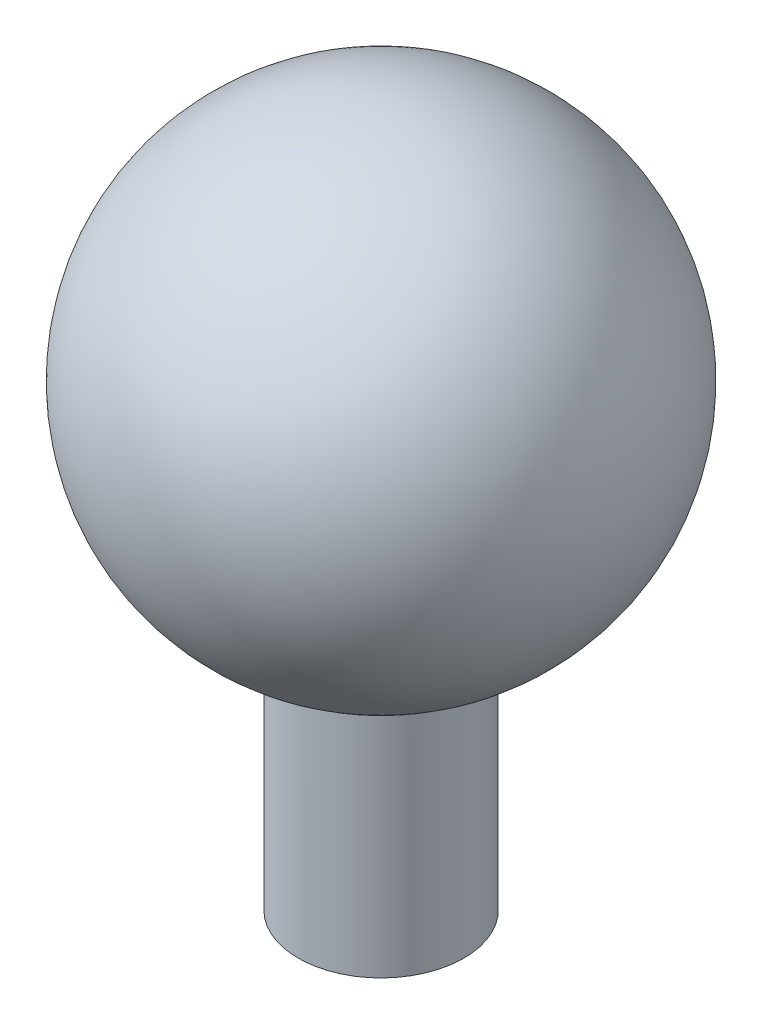
ISO-10303-21;
HEADER;
FILE_DESCRIPTION(('STEP AP214'),'2;1');
FILE_NAME('part.step','',(''),(''),'','','');
FILE_SCHEMA(('AUTOMOTIVE_DESIGN { 1 0 10303 214 1 1 1 1 }'));
ENDSEC;
DATA;
#1=APPLICATION_CONTEXT('core data for automotive mechanical design processes');
#2=APPLICATION_PROTOCOL_DEFINITION('international standard','automotive_design',2000,#1);
#3=PRODUCT_CONTEXT('',#1,'mechanical');
#4=PRODUCT('Part','Part','',(#3));
#5=PRODUCT_RELATED_PRODUCT_CATEGORY('part','',(#4));
#6=PRODUCT_DEFINITION_FORMATION('','',#4);
#7=PRODUCT_DEFINITION_CONTEXT('part definition',#1,'design');
#8=PRODUCT_DEFINITION('design','',#6,#7);
#9=PRODUCT_DEFINITION_SHAPE('','',#8);
#10=(LENGTH_UNIT() NAMED_UNIT(*) SI_UNIT(.MILLI.,.METRE.));
#11=(NAMED_UNIT(*) PLANE_ANGLE_UNIT() SI_UNIT($,.RADIAN.));
#12=(NAMED_UNIT(*) SI_UNIT($,.STERADIAN.) SOLID_ANGLE_UNIT());
#13=UNCERTAINTY_MEASURE_WITH_UNIT(LENGTH_MEASURE(1.E-05),#10,'distance_accuracy_value','');
#14=(GEOMETRIC_REPRESENTATION_CONTEXT(3) GLOBAL_UNCERTAINTY_ASSIGNED_CONTEXT((#13)) GLOBAL_UNIT_ASSIGNED_CONTEXT((#10,
#11,#12)) REPRESENTATION_CONTEXT('',''));
#15=CARTESIAN_POINT('',(0.,0.,0.));
#16=DIRECTION('',(0.,0.,1.));
#17=DIRECTION('',(1.,0.,0.));
#18=AXIS2_PLACEMENT_3D('',#15,#16,#17);
#19=CARTESIAN_POINT('',(0.,38.7349939951952,0.));
#20=DIRECTION('',(0.,-1.,0.));
#21=DIRECTION('',(-1.,0.,0.));
#22=AXIS2_PLACEMENT_3D('',#19,#20,#21);
#23=SPHERICAL_SURFACE('',#22,20.);
#24=CARTESIAN_POINT('',(0.,20.,0.));
#25=DIRECTION('',(0.,-1.,0.));
#26=DIRECTION('',(0.,0.,-1.));
#27=AXIS2_PLACEMENT_3D('',#24,#25,#26);
#28=CIRCLE('',#27,7.);
#29=CARTESIAN_POINT('',(0.,20.,-7.));
#30=VERTEX_POINT('',#29);
#31=EDGE_CURVE('E10',#30,#30,#28,.T.);
#32=ORIENTED_EDGE('',*,*,#31,.F.);
#33=EDGE_LOOP('',(#32));
#34=FACE_BOUND('',#33,.T.);
#35=ADVANCED_FACE('F38',(#34),#23,.T.);
#36=CARTESIAN_POINT('',(0.,0.,0.));
#37=DIRECTION('',(0.,-1.,0.));
#38=DIRECTION('',(0.,0.,-1.));
#39=AXIS2_PLACEMENT_3D('',#36,#37,#38);
#40=CYLINDRICAL_SURFACE('',#39,7.);
#41=ORIENTED_EDGE('',*,*,#31,.T.);
#42=EDGE_LOOP('',(#41));
#43=FACE_BOUND('',#42,.T.);
#44=CARTESIAN_POINT('',(0.,0.,0.));
#45=DIRECTION('',(0.,-1.,0.));
#46=DIRECTION('',(0.,0.,-1.));
#47=AXIS2_PLACEMENT_3D('',#44,#45,#46);
#48=CIRCLE('',#47,7.);
#49=CARTESIAN_POINT('',(0.,0.,-7.));
#50=VERTEX_POINT('',#49);
#51=EDGE_CURVE('E44',#50,#50,#48,.T.);
#52=ORIENTED_EDGE('',*,*,#51,.F.);
#53=EDGE_LOOP('',(#52));
#54=FACE_BOUND('',#53,.T.);
#55=ADVANCED_FACE('F62',(#43,#54),#40,.T.);
#56=CARTESIAN_POINT('',(0.,0.,0.));
#57=DIRECTION('',(0.,-1.,0.));
#58=DIRECTION('',(0.,0.,-1.));
#59=AXIS2_PLACEMENT_3D('',#56,#57,#58);
#60=PLANE('',#59);
#61=CARTESIAN_POINT('',(0.,0.,0.));
#62=DIRECTION('',(0.,-1.,0.));
#63=DIRECTION('',(0.,0.,-1.));
#64=AXIS2_PLACEMENT_3D('',#61,#62,#63);
#65=CIRCLE('',#64,3.);
#66=CARTESIAN_POINT('',(0.,0.,-3.));
#67=VERTEX_POINT('',#66);
#68=EDGE_CURVE('E52',#67,#67,#65,.T.);
#69=ORIENTED_EDGE('',*,*,#68,.F.);
#70=EDGE_LOOP('',(#69));
#71=FACE_BOUND('',#70,.T.);
#72=ORIENTED_EDGE('',*,*,#51,.T.);
#73=EDGE_LOOP('',(#72));
#74=FACE_BOUND('',#73,.T.);
#75=ADVANCED_FACE('F60',(#71,#74),#60,.T.);
#76=CARTESIAN_POINT('',(0.,48.,0.));
#77=DIRECTION('',(0.,-1.,0.));
#78=DIRECTION('',(0.,0.,-1.));
#79=AXIS2_PLACEMENT_3D('',#76,#77,#78);
#80=CYLINDRICAL_SURFACE('',#79,3.);
#81=CARTESIAN_POINT('',(0.,48.,0.));
#82=DIRECTION('',(0.,-1.,0.));
#83=DIRECTION('',(0.,0.,-1.));
#84=AXIS2_PLACEMENT_3D('',#81,#82,#83);
#85=CIRCLE('',#84,3.);
#86=CARTESIAN_POINT('',(0.,48.,-3.));
#87=VERTEX_POINT('',#86);
#88=EDGE_CURVE('E48',#87,#87,#85,.T.);
#89=ORIENTED_EDGE('',*,*,#88,.F.);
#90=EDGE_LOOP('',(#89));
#91=FACE_BOUND('',#90,.T.);
#92=ORIENTED_EDGE('',*,*,#68,.T.);
#93=EDGE_LOOP('',(#92));
#94=FACE_BOUND('',#93,.T.);
#95=ADVANCED_FACE('F58',(#91,#94),#80,.F.);
#96=CARTESIAN_POINT('',(0.,48.,0.));
#97=DIRECTION('',(0.,-1.,0.));
#98=DIRECTION('',(0.,0.,-1.));
#99=AXIS2_PLACEMENT_3D('',#96,#97,#98);
#100=PLANE('',#99);
#101=ORIENTED_EDGE('',*,*,#88,.T.);
#102=EDGE_LOOP('',(#101));
#103=FACE_BOUND('',#102,.T.);
#104=ADVANCED_FACE('F68',(#103),#100,.T.);
#105=CLOSED_SHELL('',(#35,#55,#75,#95,#104));
#106=MANIFOLD_SOLID_BREP('B2',#105);
#107=ADVANCED_BREP_SHAPE_REPRESENTATION('',(#18,#106),#14);
#108=SHAPE_DEFINITION_REPRESENTATION(#9,#107);
ENDSEC;
END-ISO-10303-21;
